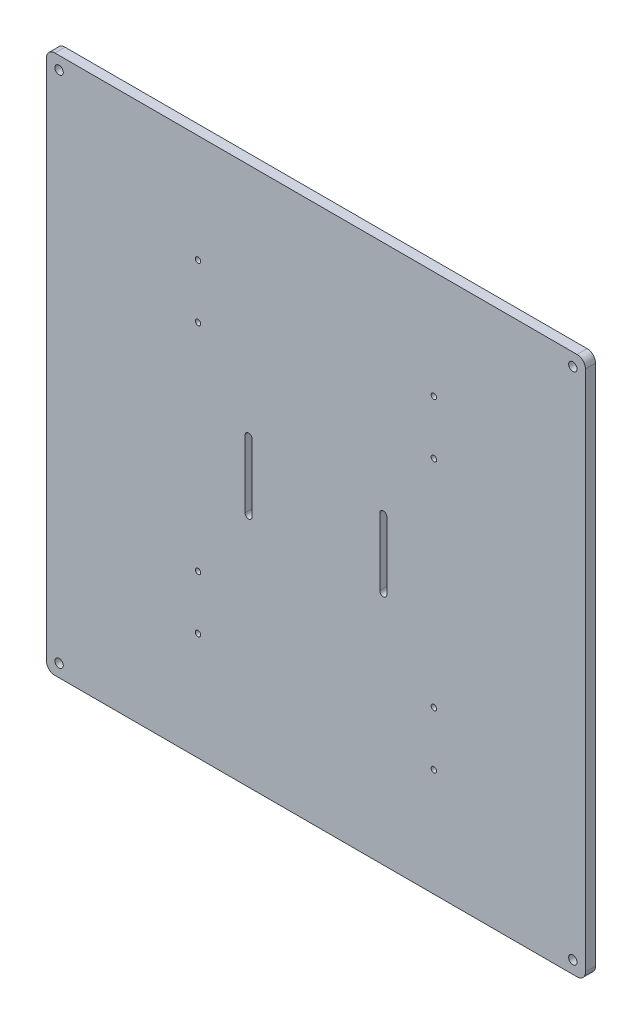
ISO-10303-21;
HEADER;
FILE_DESCRIPTION(('STEP AP214'),'2;1');
FILE_NAME('part.step','',(''),(''),'','','');
FILE_SCHEMA(('AUTOMOTIVE_DESIGN { 1 0 10303 214 1 1 1 1 }'));
ENDSEC;
DATA;
#1=APPLICATION_CONTEXT('core data for automotive mechanical design processes');
#2=APPLICATION_PROTOCOL_DEFINITION('international standard','automotive_design',2000,#1);
#3=PRODUCT_CONTEXT('',#1,'mechanical');
#4=PRODUCT('Part','Part','',(#3));
#5=PRODUCT_RELATED_PRODUCT_CATEGORY('part','',(#4));
#6=PRODUCT_DEFINITION_FORMATION('','',#4);
#7=PRODUCT_DEFINITION_CONTEXT('part definition',#1,'design');
#8=PRODUCT_DEFINITION('design','',#6,#7);
#9=PRODUCT_DEFINITION_SHAPE('','',#8);
#10=(LENGTH_UNIT() NAMED_UNIT(*) SI_UNIT(.MILLI.,.METRE.));
#11=(NAMED_UNIT(*) PLANE_ANGLE_UNIT() SI_UNIT($,.RADIAN.));
#12=(NAMED_UNIT(*) SI_UNIT($,.STERADIAN.) SOLID_ANGLE_UNIT());
#13=UNCERTAINTY_MEASURE_WITH_UNIT(LENGTH_MEASURE(1.E-05),#10,'distance_accuracy_value','');
#14=(GEOMETRIC_REPRESENTATION_CONTEXT(3) GLOBAL_UNCERTAINTY_ASSIGNED_CONTEXT((#13)) GLOBAL_UNIT_ASSIGNED_CONTEXT((#10,
#11,#12)) REPRESENTATION_CONTEXT('',''));
#15=CARTESIAN_POINT('',(0.,0.,0.));
#16=DIRECTION('',(0.,0.,1.));
#17=DIRECTION('',(1.,0.,0.));
#18=AXIS2_PLACEMENT_3D('',#15,#16,#17);
#19=CARTESIAN_POINT('',(0.,0.,6.));
#20=DIRECTION('',(0.,1.,0.));
#21=DIRECTION('',(0.,0.,1.));
#22=AXIS2_PLACEMENT_3D('',#19,#20,#21);
#23=PLANE('',#22);
#24=DIRECTION('',(1.,0.,0.));
#25=VECTOR('',#24,1.);
#26=CARTESIAN_POINT('',(0.,0.,0.));
#27=LINE('',#26,#25);
#28=CARTESIAN_POINT('',(5.,0.,0.));
#29=VERTEX_POINT('',#28);
#30=CARTESIAN_POINT('',(315.,0.,0.));
#31=VERTEX_POINT('',#30);
#32=EDGE_CURVE('E296',#29,#31,#27,.T.);
#33=ORIENTED_EDGE('',*,*,#32,.T.);
#34=DIRECTION('',(0.,0.,-1.));
#35=VECTOR('',#34,1.);
#36=CARTESIAN_POINT('',(315.,0.,6.));
#37=LINE('',#36,#35);
#38=CARTESIAN_POINT('',(315.,0.,6.));
#39=VERTEX_POINT('',#38);
#40=EDGE_CURVE('E43',#31,#39,#37,.F.);
#41=ORIENTED_EDGE('',*,*,#40,.T.);
#42=DIRECTION('',(1.,0.,0.));
#43=VECTOR('',#42,1.);
#44=CARTESIAN_POINT('',(0.,0.,6.));
#45=LINE('',#44,#43);
#46=CARTESIAN_POINT('',(5.,0.,6.));
#47=VERTEX_POINT('',#46);
#48=EDGE_CURVE('E274',#47,#39,#45,.T.);
#49=ORIENTED_EDGE('',*,*,#48,.F.);
#50=DIRECTION('',(0.,0.,-1.));
#51=VECTOR('',#50,1.);
#52=CARTESIAN_POINT('',(5.,0.,0.));
#53=LINE('',#52,#51);
#54=EDGE_CURVE('E317',#47,#29,#53,.T.);
#55=ORIENTED_EDGE('',*,*,#54,.T.);
#56=EDGE_LOOP('',(#33,#41,#49,#55));
#57=FACE_BOUND('',#56,.T.);
#58=ADVANCED_FACE('F35',(#57),#23,.F.);
#59=CARTESIAN_POINT('',(320.,0.,6.));
#60=DIRECTION('',(-1.,0.,0.));
#61=DIRECTION('',(0.,0.,1.));
#62=AXIS2_PLACEMENT_3D('',#59,#60,#61);
#63=PLANE('',#62);
#64=DIRECTION('',(0.,1.,0.));
#65=VECTOR('',#64,1.);
#66=CARTESIAN_POINT('',(320.,0.,6.));
#67=LINE('',#66,#65);
#68=CARTESIAN_POINT('',(320.,5.,6.));
#69=VERTEX_POINT('',#68);
#70=CARTESIAN_POINT('',(320.,315.,6.));
#71=VERTEX_POINT('',#70);
#72=EDGE_CURVE('E277',#69,#71,#67,.T.);
#73=ORIENTED_EDGE('',*,*,#72,.F.);
#74=DIRECTION('',(0.,0.,-1.));
#75=VECTOR('',#74,1.);
#76=CARTESIAN_POINT('',(320.,5.,6.));
#77=LINE('',#76,#75);
#78=CARTESIAN_POINT('',(320.,5.,0.));
#79=VERTEX_POINT('',#78);
#80=EDGE_CURVE('E337',#69,#79,#77,.T.);
#81=ORIENTED_EDGE('',*,*,#80,.T.);
#82=DIRECTION('',(0.,1.,0.));
#83=VECTOR('',#82,1.);
#84=CARTESIAN_POINT('',(320.,0.,0.));
#85=LINE('',#84,#83);
#86=CARTESIAN_POINT('',(320.,315.,0.));
#87=VERTEX_POINT('',#86);
#88=EDGE_CURVE('E299',#79,#87,#85,.T.);
#89=ORIENTED_EDGE('',*,*,#88,.T.);
#90=DIRECTION('',(0.,0.,-1.));
#91=VECTOR('',#90,1.);
#92=CARTESIAN_POINT('',(320.,315.,6.));
#93=LINE('',#92,#91);
#94=EDGE_CURVE('E332',#87,#71,#93,.F.);
#95=ORIENTED_EDGE('',*,*,#94,.T.);
#96=EDGE_LOOP('',(#73,#81,#89,#95));
#97=FACE_BOUND('',#96,.T.);
#98=ADVANCED_FACE('F356',(#97),#63,.F.);
#99=CARTESIAN_POINT('',(0.,320.,6.));
#100=DIRECTION('',(0.,1.,0.));
#101=DIRECTION('',(0.,0.,1.));
#102=AXIS2_PLACEMENT_3D('',#99,#100,#101);
#103=PLANE('',#102);
#104=DIRECTION('',(1.,0.,0.));
#105=VECTOR('',#104,1.);
#106=CARTESIAN_POINT('',(0.,320.,6.));
#107=LINE('',#106,#105);
#108=CARTESIAN_POINT('',(5.,320.,6.));
#109=VERTEX_POINT('',#108);
#110=CARTESIAN_POINT('',(315.,320.,6.));
#111=VERTEX_POINT('',#110);
#112=EDGE_CURVE('E279',#109,#111,#107,.T.);
#113=ORIENTED_EDGE('',*,*,#112,.T.);
#114=DIRECTION('',(0.,0.,-1.));
#115=VECTOR('',#114,1.);
#116=CARTESIAN_POINT('',(315.,320.,0.));
#117=LINE('',#116,#115);
#118=CARTESIAN_POINT('',(315.,320.,0.));
#119=VERTEX_POINT('',#118);
#120=EDGE_CURVE('E326',#111,#119,#117,.T.);
#121=ORIENTED_EDGE('',*,*,#120,.T.);
#122=DIRECTION('',(1.,0.,0.));
#123=VECTOR('',#122,1.);
#124=CARTESIAN_POINT('',(0.,320.,0.));
#125=LINE('',#124,#123);
#126=CARTESIAN_POINT('',(5.,320.,0.));
#127=VERTEX_POINT('',#126);
#128=EDGE_CURVE('E301',#127,#119,#125,.T.);
#129=ORIENTED_EDGE('',*,*,#128,.F.);
#130=DIRECTION('',(0.,0.,-1.));
#131=VECTOR('',#130,1.);
#132=CARTESIAN_POINT('',(5.,320.,6.));
#133=LINE('',#132,#131);
#134=EDGE_CURVE('E312',#127,#109,#133,.F.);
#135=ORIENTED_EDGE('',*,*,#134,.T.);
#136=EDGE_LOOP('',(#113,#121,#129,#135));
#137=FACE_BOUND('',#136,.T.);
#138=ADVANCED_FACE('F369',(#137),#103,.T.);
#139=CARTESIAN_POINT('',(0.,0.,6.));
#140=DIRECTION('',(-1.,0.,0.));
#141=DIRECTION('',(0.,0.,1.));
#142=AXIS2_PLACEMENT_3D('',#139,#140,#141);
#143=PLANE('',#142);
#144=DIRECTION('',(0.,1.,0.));
#145=VECTOR('',#144,1.);
#146=CARTESIAN_POINT('',(0.,0.,0.));
#147=LINE('',#146,#145);
#148=CARTESIAN_POINT('',(0.,5.,0.));
#149=VERTEX_POINT('',#148);
#150=CARTESIAN_POINT('',(0.,315.,0.));
#151=VERTEX_POINT('',#150);
#152=EDGE_CURVE('E304',#149,#151,#147,.T.);
#153=ORIENTED_EDGE('',*,*,#152,.F.);
#154=DIRECTION('',(0.,0.,-1.));
#155=VECTOR('',#154,1.);
#156=CARTESIAN_POINT('',(0.,5.,6.));
#157=LINE('',#156,#155);
#158=CARTESIAN_POINT('',(0.,5.,6.));
#159=VERTEX_POINT('',#158);
#160=EDGE_CURVE('E322',#149,#159,#157,.F.);
#161=ORIENTED_EDGE('',*,*,#160,.T.);
#162=DIRECTION('',(0.,1.,0.));
#163=VECTOR('',#162,1.);
#164=CARTESIAN_POINT('',(0.,0.,6.));
#165=LINE('',#164,#163);
#166=CARTESIAN_POINT('',(0.,315.,6.));
#167=VERTEX_POINT('',#166);
#168=EDGE_CURVE('E282',#159,#167,#165,.T.);
#169=ORIENTED_EDGE('',*,*,#168,.T.);
#170=DIRECTION('',(0.,0.,-1.));
#171=VECTOR('',#170,1.);
#172=CARTESIAN_POINT('',(0.,315.,6.));
#173=LINE('',#172,#171);
#174=EDGE_CURVE('E287',#167,#151,#173,.T.);
#175=ORIENTED_EDGE('',*,*,#174,.T.);
#176=EDGE_LOOP('',(#153,#161,#169,#175));
#177=FACE_BOUND('',#176,.T.);
#178=ADVANCED_FACE('F380',(#177),#143,.T.);
#179=CARTESIAN_POINT('',(7.5,312.5,6.));
#180=DIRECTION('',(0.,0.,-1.));
#181=DIRECTION('',(-1.,0.,0.));
#182=AXIS2_PLACEMENT_3D('',#179,#180,#181);
#183=CYLINDRICAL_SURFACE('',#182,2.5);
#184=CARTESIAN_POINT('',(7.5,312.5,6.));
#185=DIRECTION('',(0.,0.,1.));
#186=DIRECTION('',(1.,0.,0.));
#187=AXIS2_PLACEMENT_3D('',#184,#185,#186);
#188=CIRCLE('',#187,2.5);
#189=CARTESIAN_POINT('',(10.,312.5,6.));
#190=VERTEX_POINT('',#189);
#191=EDGE_CURVE('E271',#190,#190,#188,.T.);
#192=ORIENTED_EDGE('',*,*,#191,.T.);
#193=EDGE_LOOP('',(#192));
#194=FACE_BOUND('',#193,.T.);
#195=CARTESIAN_POINT('',(7.5,312.5,0.));
#196=DIRECTION('',(0.,0.,1.));
#197=DIRECTION('',(1.,0.,0.));
#198=AXIS2_PLACEMENT_3D('',#195,#196,#197);
#199=CIRCLE('',#198,2.5);
#200=CARTESIAN_POINT('',(10.,312.5,0.));
#201=VERTEX_POINT('',#200);
#202=EDGE_CURVE('E293',#201,#201,#199,.T.);
#203=ORIENTED_EDGE('',*,*,#202,.F.);
#204=EDGE_LOOP('',(#203));
#205=FACE_BOUND('',#204,.T.);
#206=ADVANCED_FACE('F382',(#194,#205),#183,.F.);
#207=CARTESIAN_POINT('',(312.5,312.5,6.));
#208=DIRECTION('',(0.,0.,-1.));
#209=DIRECTION('',(-1.,0.,0.));
#210=AXIS2_PLACEMENT_3D('',#207,#208,#209);
#211=CYLINDRICAL_SURFACE('',#210,2.50000000000002);
#212=CARTESIAN_POINT('',(312.5,312.5,6.));
#213=DIRECTION('',(0.,0.,1.));
#214=DIRECTION('',(1.,0.,0.));
#215=AXIS2_PLACEMENT_3D('',#212,#213,#214);
#216=CIRCLE('',#215,2.50000000000002);
#217=CARTESIAN_POINT('',(315.,312.5,6.));
#218=VERTEX_POINT('',#217);
#219=EDGE_CURVE('E267',#218,#218,#216,.F.);
#220=ORIENTED_EDGE('',*,*,#219,.F.);
#221=EDGE_LOOP('',(#220));
#222=FACE_BOUND('',#221,.T.);
#223=CARTESIAN_POINT('',(312.5,312.5,0.));
#224=DIRECTION('',(0.,0.,1.));
#225=DIRECTION('',(1.,0.,0.));
#226=AXIS2_PLACEMENT_3D('',#223,#224,#225);
#227=CIRCLE('',#226,2.50000000000002);
#228=CARTESIAN_POINT('',(315.,312.5,0.));
#229=VERTEX_POINT('',#228);
#230=EDGE_CURVE('E290',#229,#229,#227,.F.);
#231=ORIENTED_EDGE('',*,*,#230,.T.);
#232=EDGE_LOOP('',(#231));
#233=FACE_BOUND('',#232,.T.);
#234=ADVANCED_FACE('F388',(#222,#233),#211,.F.);
#235=CARTESIAN_POINT('',(312.5,7.50000000000001,6.));
#236=DIRECTION('',(0.,0.,-1.));
#237=DIRECTION('',(-1.,0.,0.));
#238=AXIS2_PLACEMENT_3D('',#235,#236,#237);
#239=CYLINDRICAL_SURFACE('',#238,2.50000000000002);
#240=CARTESIAN_POINT('',(312.5,7.50000000000001,6.));
#241=DIRECTION('',(0.,0.,1.));
#242=DIRECTION('',(1.,0.,0.));
#243=AXIS2_PLACEMENT_3D('',#240,#241,#242);
#244=CIRCLE('',#243,2.50000000000002);
#245=CARTESIAN_POINT('',(315.,7.50000000000001,6.));
#246=VERTEX_POINT('',#245);
#247=EDGE_CURVE('E264',#246,#246,#244,.T.);
#248=ORIENTED_EDGE('',*,*,#247,.T.);
#249=EDGE_LOOP('',(#248));
#250=FACE_BOUND('',#249,.T.);
#251=CARTESIAN_POINT('',(312.5,7.50000000000001,0.));
#252=DIRECTION('',(0.,0.,1.));
#253=DIRECTION('',(1.,0.,0.));
#254=AXIS2_PLACEMENT_3D('',#251,#252,#253);
#255=CIRCLE('',#254,2.50000000000002);
#256=CARTESIAN_POINT('',(315.,7.50000000000001,0.));
#257=VERTEX_POINT('',#256);
#258=EDGE_CURVE('E261',#257,#257,#255,.T.);
#259=ORIENTED_EDGE('',*,*,#258,.F.);
#260=EDGE_LOOP('',(#259));
#261=FACE_BOUND('',#260,.T.);
#262=ADVANCED_FACE('F402',(#250,#261),#239,.F.);
#263=CARTESIAN_POINT('',(7.5,7.50000000000001,6.));
#264=DIRECTION('',(0.,0.,-1.));
#265=DIRECTION('',(-1.,0.,0.));
#266=AXIS2_PLACEMENT_3D('',#263,#264,#265);
#267=CYLINDRICAL_SURFACE('',#266,2.5);
#268=CARTESIAN_POINT('',(7.5,7.50000000000001,6.));
#269=DIRECTION('',(0.,0.,1.));
#270=DIRECTION('',(1.,0.,0.));
#271=AXIS2_PLACEMENT_3D('',#268,#269,#270);
#272=CIRCLE('',#271,2.5);
#273=CARTESIAN_POINT('',(10.,7.50000000000001,6.));
#274=VERTEX_POINT('',#273);
#275=EDGE_CURVE('E284',#274,#274,#272,.F.);
#276=ORIENTED_EDGE('',*,*,#275,.F.);
#277=EDGE_LOOP('',(#276));
#278=FACE_BOUND('',#277,.T.);
#279=CARTESIAN_POINT('',(7.5,7.50000000000001,0.));
#280=DIRECTION('',(0.,0.,1.));
#281=DIRECTION('',(1.,0.,0.));
#282=AXIS2_PLACEMENT_3D('',#279,#280,#281);
#283=CIRCLE('',#282,2.5);
#284=CARTESIAN_POINT('',(10.,7.50000000000001,0.));
#285=VERTEX_POINT('',#284);
#286=EDGE_CURVE('E268',#285,#285,#283,.F.);
#287=ORIENTED_EDGE('',*,*,#286,.T.);
#288=EDGE_LOOP('',(#287));
#289=FACE_BOUND('',#288,.T.);
#290=ADVANCED_FACE('F406',(#278,#289),#267,.F.);
#291=CARTESIAN_POINT('',(0.,0.,6.));
#292=DIRECTION('',(0.,0.,1.));
#293=DIRECTION('',(1.,0.,0.));
#294=AXIS2_PLACEMENT_3D('',#291,#292,#293);
#295=PLANE('',#294);
#296=CARTESIAN_POINT('',(120.,180.,6.));
#297=DIRECTION('',(0.,0.,-1.));
#298=DIRECTION('',(-1.,0.,0.));
#299=AXIS2_PLACEMENT_3D('',#296,#297,#298);
#300=CIRCLE('',#299,2.09999999999999);
#301=CARTESIAN_POINT('',(117.9,180.,6.));
#302=VERTEX_POINT('',#301);
#303=CARTESIAN_POINT('',(122.1,180.,6.));
#304=VERTEX_POINT('',#303);
#305=EDGE_CURVE('E149',#302,#304,#300,.T.);
#306=ORIENTED_EDGE('',*,*,#305,.T.);
#307=DIRECTION('',(0.,-1.,0.));
#308=VECTOR('',#307,1.);
#309=CARTESIAN_POINT('',(122.1,180.,6.));
#310=LINE('',#309,#308);
#311=CARTESIAN_POINT('',(122.1,140.,6.));
#312=VERTEX_POINT('',#311);
#313=EDGE_CURVE('E158',#304,#312,#310,.T.);
#314=ORIENTED_EDGE('',*,*,#313,.T.);
#315=CARTESIAN_POINT('',(120.,140.,6.));
#316=DIRECTION('',(0.,0.,-1.));
#317=DIRECTION('',(-1.,0.,0.));
#318=AXIS2_PLACEMENT_3D('',#315,#316,#317);
#319=CIRCLE('',#318,2.09999999999998);
#320=CARTESIAN_POINT('',(117.9,140.,6.));
#321=VERTEX_POINT('',#320);
#322=EDGE_CURVE('E50',#312,#321,#319,.T.);
#323=ORIENTED_EDGE('',*,*,#322,.T.);
#324=DIRECTION('',(0.,1.,0.));
#325=VECTOR('',#324,1.);
#326=CARTESIAN_POINT('',(117.9,180.,6.));
#327=LINE('',#326,#325);
#328=EDGE_CURVE('E155',#321,#302,#327,.T.);
#329=ORIENTED_EDGE('',*,*,#328,.T.);
#330=EDGE_LOOP('',(#306,#314,#323,#329));
#331=FACE_BOUND('',#330,.T.);
#332=CARTESIAN_POINT('',(200.,180.,6.));
#333=DIRECTION('',(0.,0.,-1.));
#334=DIRECTION('',(-1.,0.,0.));
#335=AXIS2_PLACEMENT_3D('',#332,#333,#334);
#336=CIRCLE('',#335,2.10000000000002);
#337=CARTESIAN_POINT('',(197.9,180.,6.));
#338=VERTEX_POINT('',#337);
#339=CARTESIAN_POINT('',(202.1,180.,6.));
#340=VERTEX_POINT('',#339);
#341=EDGE_CURVE('E184',#338,#340,#336,.T.);
#342=ORIENTED_EDGE('',*,*,#341,.T.);
#343=DIRECTION('',(0.,-1.,0.));
#344=VECTOR('',#343,1.);
#345=CARTESIAN_POINT('',(202.1,180.,6.));
#346=LINE('',#345,#344);
#347=CARTESIAN_POINT('',(202.1,140.,6.));
#348=VERTEX_POINT('',#347);
#349=EDGE_CURVE('E187',#340,#348,#346,.T.);
#350=ORIENTED_EDGE('',*,*,#349,.T.);
#351=CARTESIAN_POINT('',(200.,140.,6.));
#352=DIRECTION('',(0.,0.,-1.));
#353=DIRECTION('',(-1.,0.,0.));
#354=AXIS2_PLACEMENT_3D('',#351,#352,#353);
#355=CIRCLE('',#354,2.09999999999999);
#356=CARTESIAN_POINT('',(197.9,140.,6.));
#357=VERTEX_POINT('',#356);
#358=EDGE_CURVE('E191',#348,#357,#355,.T.);
#359=ORIENTED_EDGE('',*,*,#358,.T.);
#360=DIRECTION('',(0.,1.,0.));
#361=VECTOR('',#360,1.);
#362=CARTESIAN_POINT('',(197.9,180.,6.));
#363=LINE('',#362,#361);
#364=EDGE_CURVE('E194',#357,#338,#363,.T.);
#365=ORIENTED_EDGE('',*,*,#364,.T.);
#366=EDGE_LOOP('',(#342,#350,#359,#365));
#367=FACE_BOUND('',#366,.T.);
#368=CARTESIAN_POINT('',(230.,256.,6.));
#369=DIRECTION('',(0.,0.,1.));
#370=DIRECTION('',(1.,0.,0.));
#371=AXIS2_PLACEMENT_3D('',#368,#369,#370);
#372=CIRCLE('',#371,1.59999999999999);
#373=CARTESIAN_POINT('',(231.6,256.,6.));
#374=VERTEX_POINT('',#373);
#375=EDGE_CURVE('E209',#374,#374,#372,.T.);
#376=ORIENTED_EDGE('',*,*,#375,.F.);
#377=EDGE_LOOP('',(#376));
#378=FACE_BOUND('',#377,.T.);
#379=CARTESIAN_POINT('',(230.,64.,6.));
#380=DIRECTION('',(0.,0.,1.));
#381=DIRECTION('',(1.,0.,0.));
#382=AXIS2_PLACEMENT_3D('',#379,#380,#381);
#383=CIRCLE('',#382,1.59999999999999);
#384=CARTESIAN_POINT('',(231.6,64.,6.));
#385=VERTEX_POINT('',#384);
#386=EDGE_CURVE('E219',#385,#385,#383,.T.);
#387=ORIENTED_EDGE('',*,*,#386,.F.);
#388=EDGE_LOOP('',(#387));
#389=FACE_BOUND('',#388,.T.);
#390=CARTESIAN_POINT('',(90.,64.,6.));
#391=DIRECTION('',(0.,0.,1.));
#392=DIRECTION('',(1.,0.,0.));
#393=AXIS2_PLACEMENT_3D('',#390,#391,#392);
#394=CIRCLE('',#393,1.60000000000001);
#395=CARTESIAN_POINT('',(91.6,64.,6.));
#396=VERTEX_POINT('',#395);
#397=EDGE_CURVE('E225',#396,#396,#394,.T.);
#398=ORIENTED_EDGE('',*,*,#397,.F.);
#399=EDGE_LOOP('',(#398));
#400=FACE_BOUND('',#399,.T.);
#401=CARTESIAN_POINT('',(90.,256.,6.));
#402=DIRECTION('',(0.,0.,1.));
#403=DIRECTION('',(1.,0.,0.));
#404=AXIS2_PLACEMENT_3D('',#401,#402,#403);
#405=CIRCLE('',#404,1.6);
#406=CARTESIAN_POINT('',(91.6,256.,6.));
#407=VERTEX_POINT('',#406);
#408=EDGE_CURVE('E231',#407,#407,#405,.T.);
#409=ORIENTED_EDGE('',*,*,#408,.F.);
#410=EDGE_LOOP('',(#409));
#411=FACE_BOUND('',#410,.T.);
#412=CARTESIAN_POINT('',(230.,96.,6.));
#413=DIRECTION('',(0.,0.,1.));
#414=DIRECTION('',(1.,0.,0.));
#415=AXIS2_PLACEMENT_3D('',#412,#413,#414);
#416=CIRCLE('',#415,1.59999999999996);
#417=CARTESIAN_POINT('',(231.6,96.,6.));
#418=VERTEX_POINT('',#417);
#419=EDGE_CURVE('E237',#418,#418,#416,.T.);
#420=ORIENTED_EDGE('',*,*,#419,.F.);
#421=EDGE_LOOP('',(#420));
#422=FACE_BOUND('',#421,.T.);
#423=CARTESIAN_POINT('',(90.,96.,6.));
#424=DIRECTION('',(0.,0.,1.));
#425=DIRECTION('',(1.,0.,0.));
#426=AXIS2_PLACEMENT_3D('',#423,#424,#425);
#427=CIRCLE('',#426,1.60000000000001);
#428=CARTESIAN_POINT('',(91.6,96.,6.));
#429=VERTEX_POINT('',#428);
#430=EDGE_CURVE('E243',#429,#429,#427,.T.);
#431=ORIENTED_EDGE('',*,*,#430,.F.);
#432=EDGE_LOOP('',(#431));
#433=FACE_BOUND('',#432,.T.);
#434=CARTESIAN_POINT('',(230.,224.,6.));
#435=DIRECTION('',(0.,0.,1.));
#436=DIRECTION('',(1.,0.,0.));
#437=AXIS2_PLACEMENT_3D('',#434,#435,#436);
#438=CIRCLE('',#437,1.59999999999996);
#439=CARTESIAN_POINT('',(231.6,224.,6.));
#440=VERTEX_POINT('',#439);
#441=EDGE_CURVE('E249',#440,#440,#438,.T.);
#442=ORIENTED_EDGE('',*,*,#441,.F.);
#443=EDGE_LOOP('',(#442));
#444=FACE_BOUND('',#443,.T.);
#445=CARTESIAN_POINT('',(90.,224.,6.));
#446=DIRECTION('',(0.,0.,1.));
#447=DIRECTION('',(1.,0.,0.));
#448=AXIS2_PLACEMENT_3D('',#445,#446,#447);
#449=CIRCLE('',#448,1.6);
#450=CARTESIAN_POINT('',(91.6,224.,6.));
#451=VERTEX_POINT('',#450);
#452=EDGE_CURVE('E255',#451,#451,#449,.T.);
#453=ORIENTED_EDGE('',*,*,#452,.F.);
#454=EDGE_LOOP('',(#453));
#455=FACE_BOUND('',#454,.T.);
#456=ORIENTED_EDGE('',*,*,#247,.F.);
#457=EDGE_LOOP('',(#456));
#458=FACE_BOUND('',#457,.T.);
#459=ORIENTED_EDGE('',*,*,#219,.T.);
#460=EDGE_LOOP('',(#459));
#461=FACE_BOUND('',#460,.T.);
#462=ORIENTED_EDGE('',*,*,#191,.F.);
#463=EDGE_LOOP('',(#462));
#464=FACE_BOUND('',#463,.T.);
#465=ORIENTED_EDGE('',*,*,#48,.T.);
#466=CARTESIAN_POINT('',(315.,5.,6.));
#467=DIRECTION('',(0.,0.,1.));
#468=DIRECTION('',(1.,0.,0.));
#469=AXIS2_PLACEMENT_3D('',#466,#467,#468);
#470=CIRCLE('',#469,5.);
#471=EDGE_CURVE('E11',#39,#69,#470,.T.);
#472=ORIENTED_EDGE('',*,*,#471,.T.);
#473=ORIENTED_EDGE('',*,*,#72,.T.);
#474=CARTESIAN_POINT('',(315.,315.,6.));
#475=DIRECTION('',(0.,0.,1.));
#476=DIRECTION('',(1.,0.,0.));
#477=AXIS2_PLACEMENT_3D('',#474,#475,#476);
#478=CIRCLE('',#477,5.);
#479=EDGE_CURVE('E335',#71,#111,#478,.T.);
#480=ORIENTED_EDGE('',*,*,#479,.T.);
#481=ORIENTED_EDGE('',*,*,#112,.F.);
#482=CARTESIAN_POINT('',(5.,315.,6.));
#483=DIRECTION('',(0.,0.,1.));
#484=DIRECTION('',(1.,0.,0.));
#485=AXIS2_PLACEMENT_3D('',#482,#483,#484);
#486=CIRCLE('',#485,5.);
#487=EDGE_CURVE('E314',#109,#167,#486,.T.);
#488=ORIENTED_EDGE('',*,*,#487,.T.);
#489=ORIENTED_EDGE('',*,*,#168,.F.);
#490=CARTESIAN_POINT('',(5.,5.,6.));
#491=DIRECTION('',(0.,0.,1.));
#492=DIRECTION('',(1.,0.,0.));
#493=AXIS2_PLACEMENT_3D('',#490,#491,#492);
#494=CIRCLE('',#493,5.);
#495=EDGE_CURVE('E324',#159,#47,#494,.T.);
#496=ORIENTED_EDGE('',*,*,#495,.T.);
#497=EDGE_LOOP('',(#465,#472,#473,#480,#481,#488,#489,#496));
#498=FACE_BOUND('',#497,.T.);
#499=ORIENTED_EDGE('',*,*,#275,.T.);
#500=EDGE_LOOP('',(#499));
#501=FACE_BOUND('',#500,.T.);
#502=ADVANCED_FACE('F162',(#331,#367,#378,#389,#400,#411,#422,#433,#444,#455,#458,#461,#464,
#498,#501),#295,.T.);
#503=CARTESIAN_POINT('',(0.,0.,0.));
#504=DIRECTION('',(0.,0.,1.));
#505=DIRECTION('',(1.,0.,0.));
#506=AXIS2_PLACEMENT_3D('',#503,#504,#505);
#507=PLANE('',#506);
#508=DIRECTION('',(0.,-1.,0.));
#509=VECTOR('',#508,1.);
#510=CARTESIAN_POINT('',(122.1,180.,0.));
#511=LINE('',#510,#509);
#512=CARTESIAN_POINT('',(122.1,180.,0.));
#513=VERTEX_POINT('',#512);
#514=CARTESIAN_POINT('',(122.1,140.,0.));
#515=VERTEX_POINT('',#514);
#516=EDGE_CURVE('E174',#513,#515,#511,.T.);
#517=ORIENTED_EDGE('',*,*,#516,.F.);
#518=CARTESIAN_POINT('',(120.,180.,0.));
#519=DIRECTION('',(0.,0.,-1.));
#520=DIRECTION('',(-1.,0.,0.));
#521=AXIS2_PLACEMENT_3D('',#518,#519,#520);
#522=CIRCLE('',#521,2.09999999999999);
#523=CARTESIAN_POINT('',(117.9,180.,0.));
#524=VERTEX_POINT('',#523);
#525=EDGE_CURVE('E58',#524,#513,#522,.T.);
#526=ORIENTED_EDGE('',*,*,#525,.F.);
#527=DIRECTION('',(0.,1.,0.));
#528=VECTOR('',#527,1.);
#529=CARTESIAN_POINT('',(117.9,180.,0.));
#530=LINE('',#529,#528);
#531=CARTESIAN_POINT('',(117.9,140.,0.));
#532=VERTEX_POINT('',#531);
#533=EDGE_CURVE('E165',#532,#524,#530,.T.);
#534=ORIENTED_EDGE('',*,*,#533,.F.);
#535=CARTESIAN_POINT('',(120.,140.,0.));
#536=DIRECTION('',(0.,0.,-1.));
#537=DIRECTION('',(-1.,0.,0.));
#538=AXIS2_PLACEMENT_3D('',#535,#536,#537);
#539=CIRCLE('',#538,2.09999999999998);
#540=EDGE_CURVE('E168',#515,#532,#539,.T.);
#541=ORIENTED_EDGE('',*,*,#540,.F.);
#542=EDGE_LOOP('',(#517,#526,#534,#541));
#543=FACE_BOUND('',#542,.T.);
#544=DIRECTION('',(0.,-1.,0.));
#545=VECTOR('',#544,1.);
#546=CARTESIAN_POINT('',(202.1,180.,0.));
#547=LINE('',#546,#545);
#548=CARTESIAN_POINT('',(202.1,180.,0.));
#549=VERTEX_POINT('',#548);
#550=CARTESIAN_POINT('',(202.1,140.,0.));
#551=VERTEX_POINT('',#550);
#552=EDGE_CURVE('E199',#549,#551,#547,.T.);
#553=ORIENTED_EDGE('',*,*,#552,.F.);
#554=CARTESIAN_POINT('',(200.,180.,0.));
#555=DIRECTION('',(0.,0.,-1.));
#556=DIRECTION('',(-1.,0.,0.));
#557=AXIS2_PLACEMENT_3D('',#554,#555,#556);
#558=CIRCLE('',#557,2.10000000000002);
#559=CARTESIAN_POINT('',(197.9,180.,0.));
#560=VERTEX_POINT('',#559);
#561=EDGE_CURVE('E180',#560,#549,#558,.T.);
#562=ORIENTED_EDGE('',*,*,#561,.F.);
#563=DIRECTION('',(0.,1.,0.));
#564=VECTOR('',#563,1.);
#565=CARTESIAN_POINT('',(197.9,180.,0.));
#566=LINE('',#565,#564);
#567=CARTESIAN_POINT('',(197.9,140.,0.));
#568=VERTEX_POINT('',#567);
#569=EDGE_CURVE('E188',#568,#560,#566,.T.);
#570=ORIENTED_EDGE('',*,*,#569,.F.);
#571=CARTESIAN_POINT('',(200.,140.,0.));
#572=DIRECTION('',(0.,0.,-1.));
#573=DIRECTION('',(-1.,0.,0.));
#574=AXIS2_PLACEMENT_3D('',#571,#572,#573);
#575=CIRCLE('',#574,2.09999999999999);
#576=EDGE_CURVE('E202',#551,#568,#575,.T.);
#577=ORIENTED_EDGE('',*,*,#576,.F.);
#578=EDGE_LOOP('',(#553,#562,#570,#577));
#579=FACE_BOUND('',#578,.T.);
#580=CARTESIAN_POINT('',(230.,256.,0.));
#581=DIRECTION('',(0.,0.,1.));
#582=DIRECTION('',(1.,0.,0.));
#583=AXIS2_PLACEMENT_3D('',#580,#581,#582);
#584=CIRCLE('',#583,1.59999999999999);
#585=CARTESIAN_POINT('',(231.6,256.,0.));
#586=VERTEX_POINT('',#585);
#587=EDGE_CURVE('E216',#586,#586,#584,.T.);
#588=ORIENTED_EDGE('',*,*,#587,.T.);
#589=EDGE_LOOP('',(#588));
#590=FACE_BOUND('',#589,.T.);
#591=CARTESIAN_POINT('',(230.,64.,0.));
#592=DIRECTION('',(0.,0.,1.));
#593=DIRECTION('',(1.,0.,0.));
#594=AXIS2_PLACEMENT_3D('',#591,#592,#593);
#595=CIRCLE('',#594,1.59999999999999);
#596=CARTESIAN_POINT('',(231.6,64.,0.));
#597=VERTEX_POINT('',#596);
#598=EDGE_CURVE('E222',#597,#597,#595,.T.);
#599=ORIENTED_EDGE('',*,*,#598,.T.);
#600=EDGE_LOOP('',(#599));
#601=FACE_BOUND('',#600,.T.);
#602=CARTESIAN_POINT('',(90.,64.,0.));
#603=DIRECTION('',(0.,0.,1.));
#604=DIRECTION('',(1.,0.,0.));
#605=AXIS2_PLACEMENT_3D('',#602,#603,#604);
#606=CIRCLE('',#605,1.60000000000001);
#607=CARTESIAN_POINT('',(91.6,64.,0.));
#608=VERTEX_POINT('',#607);
#609=EDGE_CURVE('E228',#608,#608,#606,.T.);
#610=ORIENTED_EDGE('',*,*,#609,.T.);
#611=EDGE_LOOP('',(#610));
#612=FACE_BOUND('',#611,.T.);
#613=CARTESIAN_POINT('',(90.,256.,0.));
#614=DIRECTION('',(0.,0.,1.));
#615=DIRECTION('',(1.,0.,0.));
#616=AXIS2_PLACEMENT_3D('',#613,#614,#615);
#617=CIRCLE('',#616,1.6);
#618=CARTESIAN_POINT('',(91.6,256.,0.));
#619=VERTEX_POINT('',#618);
#620=EDGE_CURVE('E234',#619,#619,#617,.T.);
#621=ORIENTED_EDGE('',*,*,#620,.T.);
#622=EDGE_LOOP('',(#621));
#623=FACE_BOUND('',#622,.T.);
#624=CARTESIAN_POINT('',(230.,96.,0.));
#625=DIRECTION('',(0.,0.,1.));
#626=DIRECTION('',(1.,0.,0.));
#627=AXIS2_PLACEMENT_3D('',#624,#625,#626);
#628=CIRCLE('',#627,1.59999999999996);
#629=CARTESIAN_POINT('',(231.6,96.,0.));
#630=VERTEX_POINT('',#629);
#631=EDGE_CURVE('E240',#630,#630,#628,.T.);
#632=ORIENTED_EDGE('',*,*,#631,.T.);
#633=EDGE_LOOP('',(#632));
#634=FACE_BOUND('',#633,.T.);
#635=CARTESIAN_POINT('',(90.,96.,0.));
#636=DIRECTION('',(0.,0.,1.));
#637=DIRECTION('',(1.,0.,0.));
#638=AXIS2_PLACEMENT_3D('',#635,#636,#637);
#639=CIRCLE('',#638,1.60000000000001);
#640=CARTESIAN_POINT('',(91.6,96.,0.));
#641=VERTEX_POINT('',#640);
#642=EDGE_CURVE('E246',#641,#641,#639,.T.);
#643=ORIENTED_EDGE('',*,*,#642,.T.);
#644=EDGE_LOOP('',(#643));
#645=FACE_BOUND('',#644,.T.);
#646=CARTESIAN_POINT('',(230.,224.,0.));
#647=DIRECTION('',(0.,0.,1.));
#648=DIRECTION('',(1.,0.,0.));
#649=AXIS2_PLACEMENT_3D('',#646,#647,#648);
#650=CIRCLE('',#649,1.59999999999996);
#651=CARTESIAN_POINT('',(231.6,224.,0.));
#652=VERTEX_POINT('',#651);
#653=EDGE_CURVE('E252',#652,#652,#650,.T.);
#654=ORIENTED_EDGE('',*,*,#653,.T.);
#655=EDGE_LOOP('',(#654));
#656=FACE_BOUND('',#655,.T.);
#657=CARTESIAN_POINT('',(90.,224.,0.));
#658=DIRECTION('',(0.,0.,1.));
#659=DIRECTION('',(1.,0.,0.));
#660=AXIS2_PLACEMENT_3D('',#657,#658,#659);
#661=CIRCLE('',#660,1.6);
#662=CARTESIAN_POINT('',(91.6,224.,0.));
#663=VERTEX_POINT('',#662);
#664=EDGE_CURVE('E258',#663,#663,#661,.T.);
#665=ORIENTED_EDGE('',*,*,#664,.T.);
#666=EDGE_LOOP('',(#665));
#667=FACE_BOUND('',#666,.T.);
#668=ORIENTED_EDGE('',*,*,#258,.T.);
#669=EDGE_LOOP('',(#668));
#670=FACE_BOUND('',#669,.T.);
#671=ORIENTED_EDGE('',*,*,#230,.F.);
#672=EDGE_LOOP('',(#671));
#673=FACE_BOUND('',#672,.T.);
#674=ORIENTED_EDGE('',*,*,#202,.T.);
#675=EDGE_LOOP('',(#674));
#676=FACE_BOUND('',#675,.T.);
#677=ORIENTED_EDGE('',*,*,#88,.F.);
#678=CARTESIAN_POINT('',(315.,5.,0.));
#679=DIRECTION('',(0.,0.,1.));
#680=DIRECTION('',(1.,0.,0.));
#681=AXIS2_PLACEMENT_3D('',#678,#679,#680);
#682=CIRCLE('',#681,5.);
#683=EDGE_CURVE('E340',#79,#31,#682,.F.);
#684=ORIENTED_EDGE('',*,*,#683,.T.);
#685=ORIENTED_EDGE('',*,*,#32,.F.);
#686=CARTESIAN_POINT('',(5.,5.,0.));
#687=DIRECTION('',(0.,0.,1.));
#688=DIRECTION('',(1.,0.,0.));
#689=AXIS2_PLACEMENT_3D('',#686,#687,#688);
#690=CIRCLE('',#689,5.);
#691=EDGE_CURVE('E320',#29,#149,#690,.F.);
#692=ORIENTED_EDGE('',*,*,#691,.T.);
#693=ORIENTED_EDGE('',*,*,#152,.T.);
#694=CARTESIAN_POINT('',(5.,315.,0.));
#695=DIRECTION('',(0.,0.,1.));
#696=DIRECTION('',(1.,0.,0.));
#697=AXIS2_PLACEMENT_3D('',#694,#695,#696);
#698=CIRCLE('',#697,5.);
#699=EDGE_CURVE('E310',#151,#127,#698,.F.);
#700=ORIENTED_EDGE('',*,*,#699,.T.);
#701=ORIENTED_EDGE('',*,*,#128,.T.);
#702=CARTESIAN_POINT('',(315.,315.,0.));
#703=DIRECTION('',(0.,0.,1.));
#704=DIRECTION('',(1.,0.,0.));
#705=AXIS2_PLACEMENT_3D('',#702,#703,#704);
#706=CIRCLE('',#705,5.);
#707=EDGE_CURVE('E329',#119,#87,#706,.F.);
#708=ORIENTED_EDGE('',*,*,#707,.T.);
#709=EDGE_LOOP('',(#677,#684,#685,#692,#693,#700,#701,#708));
#710=FACE_BOUND('',#709,.T.);
#711=ORIENTED_EDGE('',*,*,#286,.F.);
#712=EDGE_LOOP('',(#711));
#713=FACE_BOUND('',#712,.T.);
#714=ADVANCED_FACE('F358',(#543,#579,#590,#601,#612,#623,#634,#645,#656,#667,#670,#673,#676,
#710,#713),#507,.F.);
#715=CARTESIAN_POINT('',(5.,315.,6.));
#716=DIRECTION('',(0.,0.,-1.));
#717=DIRECTION('',(-1.,0.,0.));
#718=AXIS2_PLACEMENT_3D('',#715,#716,#717);
#719=CYLINDRICAL_SURFACE('',#718,5.);
#720=ORIENTED_EDGE('',*,*,#487,.F.);
#721=ORIENTED_EDGE('',*,*,#134,.F.);
#722=ORIENTED_EDGE('',*,*,#699,.F.);
#723=ORIENTED_EDGE('',*,*,#174,.F.);
#724=EDGE_LOOP('',(#720,#721,#722,#723));
#725=FACE_BOUND('',#724,.T.);
#726=ADVANCED_FACE('F373',(#725),#719,.T.);
#727=CARTESIAN_POINT('',(5.,5.,6.));
#728=DIRECTION('',(0.,0.,1.));
#729=DIRECTION('',(1.,0.,0.));
#730=AXIS2_PLACEMENT_3D('',#727,#728,#729);
#731=CYLINDRICAL_SURFACE('',#730,5.);
#732=ORIENTED_EDGE('',*,*,#495,.F.);
#733=ORIENTED_EDGE('',*,*,#160,.F.);
#734=ORIENTED_EDGE('',*,*,#691,.F.);
#735=ORIENTED_EDGE('',*,*,#54,.F.);
#736=EDGE_LOOP('',(#732,#733,#734,#735));
#737=FACE_BOUND('',#736,.T.);
#738=ADVANCED_FACE('F378',(#737),#731,.T.);
#739=CARTESIAN_POINT('',(315.,315.,6.));
#740=DIRECTION('',(0.,0.,1.));
#741=DIRECTION('',(1.,0.,0.));
#742=AXIS2_PLACEMENT_3D('',#739,#740,#741);
#743=CYLINDRICAL_SURFACE('',#742,5.);
#744=ORIENTED_EDGE('',*,*,#479,.F.);
#745=ORIENTED_EDGE('',*,*,#94,.F.);
#746=ORIENTED_EDGE('',*,*,#707,.F.);
#747=ORIENTED_EDGE('',*,*,#120,.F.);
#748=EDGE_LOOP('',(#744,#745,#746,#747));
#749=FACE_BOUND('',#748,.T.);
#750=ADVANCED_FACE('F365',(#749),#743,.T.);
#751=CARTESIAN_POINT('',(315.,5.,6.));
#752=DIRECTION('',(0.,0.,-1.));
#753=DIRECTION('',(-1.,0.,0.));
#754=AXIS2_PLACEMENT_3D('',#751,#752,#753);
#755=CYLINDRICAL_SURFACE('',#754,5.);
#756=ORIENTED_EDGE('',*,*,#471,.F.);
#757=ORIENTED_EDGE('',*,*,#40,.F.);
#758=ORIENTED_EDGE('',*,*,#683,.F.);
#759=ORIENTED_EDGE('',*,*,#80,.F.);
#760=EDGE_LOOP('',(#756,#757,#758,#759));
#761=FACE_BOUND('',#760,.T.);
#762=ADVANCED_FACE('F37',(#761),#755,.T.);
#763=CARTESIAN_POINT('',(90.,224.,0.));
#764=DIRECTION('',(0.,0.,1.));
#765=DIRECTION('',(1.,0.,0.));
#766=AXIS2_PLACEMENT_3D('',#763,#764,#765);
#767=CYLINDRICAL_SURFACE('',#766,1.6);
#768=ORIENTED_EDGE('',*,*,#664,.F.);
#769=EDGE_LOOP('',(#768));
#770=FACE_BOUND('',#769,.T.);
#771=ORIENTED_EDGE('',*,*,#452,.T.);
#772=EDGE_LOOP('',(#771));
#773=FACE_BOUND('',#772,.T.);
#774=ADVANCED_FACE('F415',(#770,#773),#767,.F.);
#775=CARTESIAN_POINT('',(230.,224.,0.));
#776=DIRECTION('',(0.,0.,1.));
#777=DIRECTION('',(1.,0.,0.));
#778=AXIS2_PLACEMENT_3D('',#775,#776,#777);
#779=CYLINDRICAL_SURFACE('',#778,1.59999999999996);
#780=ORIENTED_EDGE('',*,*,#653,.F.);
#781=EDGE_LOOP('',(#780));
#782=FACE_BOUND('',#781,.T.);
#783=ORIENTED_EDGE('',*,*,#441,.T.);
#784=EDGE_LOOP('',(#783));
#785=FACE_BOUND('',#784,.T.);
#786=ADVANCED_FACE('F419',(#782,#785),#779,.F.);
#787=CARTESIAN_POINT('',(90.,96.,0.));
#788=DIRECTION('',(0.,0.,1.));
#789=DIRECTION('',(1.,0.,0.));
#790=AXIS2_PLACEMENT_3D('',#787,#788,#789);
#791=CYLINDRICAL_SURFACE('',#790,1.60000000000001);
#792=ORIENTED_EDGE('',*,*,#642,.F.);
#793=EDGE_LOOP('',(#792));
#794=FACE_BOUND('',#793,.T.);
#795=ORIENTED_EDGE('',*,*,#430,.T.);
#796=EDGE_LOOP('',(#795));
#797=FACE_BOUND('',#796,.T.);
#798=ADVANCED_FACE('F425',(#794,#797),#791,.F.);
#799=CARTESIAN_POINT('',(230.,96.,0.));
#800=DIRECTION('',(0.,0.,1.));
#801=DIRECTION('',(1.,0.,0.));
#802=AXIS2_PLACEMENT_3D('',#799,#800,#801);
#803=CYLINDRICAL_SURFACE('',#802,1.59999999999996);
#804=ORIENTED_EDGE('',*,*,#631,.F.);
#805=EDGE_LOOP('',(#804));
#806=FACE_BOUND('',#805,.T.);
#807=ORIENTED_EDGE('',*,*,#419,.T.);
#808=EDGE_LOOP('',(#807));
#809=FACE_BOUND('',#808,.T.);
#810=ADVANCED_FACE('F512',(#806,#809),#803,.F.);
#811=CARTESIAN_POINT('',(90.,256.,0.));
#812=DIRECTION('',(0.,0.,1.));
#813=DIRECTION('',(1.,0.,0.));
#814=AXIS2_PLACEMENT_3D('',#811,#812,#813);
#815=CYLINDRICAL_SURFACE('',#814,1.6);
#816=ORIENTED_EDGE('',*,*,#620,.F.);
#817=EDGE_LOOP('',(#816));
#818=FACE_BOUND('',#817,.T.);
#819=ORIENTED_EDGE('',*,*,#408,.T.);
#820=EDGE_LOOP('',(#819));
#821=FACE_BOUND('',#820,.T.);
#822=ADVANCED_FACE('F521',(#818,#821),#815,.F.);
#823=CARTESIAN_POINT('',(90.,64.,0.));
#824=DIRECTION('',(0.,0.,1.));
#825=DIRECTION('',(1.,0.,0.));
#826=AXIS2_PLACEMENT_3D('',#823,#824,#825);
#827=CYLINDRICAL_SURFACE('',#826,1.60000000000001);
#828=ORIENTED_EDGE('',*,*,#609,.F.);
#829=EDGE_LOOP('',(#828));
#830=FACE_BOUND('',#829,.T.);
#831=ORIENTED_EDGE('',*,*,#397,.T.);
#832=EDGE_LOOP('',(#831));
#833=FACE_BOUND('',#832,.T.);
#834=ADVANCED_FACE('F531',(#830,#833),#827,.F.);
#835=CARTESIAN_POINT('',(230.,64.,0.));
#836=DIRECTION('',(0.,0.,1.));
#837=DIRECTION('',(1.,0.,0.));
#838=AXIS2_PLACEMENT_3D('',#835,#836,#837);
#839=CYLINDRICAL_SURFACE('',#838,1.59999999999999);
#840=ORIENTED_EDGE('',*,*,#598,.F.);
#841=EDGE_LOOP('',(#840));
#842=FACE_BOUND('',#841,.T.);
#843=ORIENTED_EDGE('',*,*,#386,.T.);
#844=EDGE_LOOP('',(#843));
#845=FACE_BOUND('',#844,.T.);
#846=ADVANCED_FACE('F541',(#842,#845),#839,.F.);
#847=CARTESIAN_POINT('',(230.,256.,0.));
#848=DIRECTION('',(0.,0.,1.));
#849=DIRECTION('',(1.,0.,0.));
#850=AXIS2_PLACEMENT_3D('',#847,#848,#849);
#851=CYLINDRICAL_SURFACE('',#850,1.59999999999999);
#852=ORIENTED_EDGE('',*,*,#587,.F.);
#853=EDGE_LOOP('',(#852));
#854=FACE_BOUND('',#853,.T.);
#855=ORIENTED_EDGE('',*,*,#375,.T.);
#856=EDGE_LOOP('',(#855));
#857=FACE_BOUND('',#856,.T.);
#858=ADVANCED_FACE('F550',(#854,#857),#851,.F.);
#859=CARTESIAN_POINT('',(200.,180.,6.));
#860=DIRECTION('',(0.,0.,-1.));
#861=DIRECTION('',(-1.,0.,0.));
#862=AXIS2_PLACEMENT_3D('',#859,#860,#861);
#863=CYLINDRICAL_SURFACE('',#862,2.10000000000002);
#864=ORIENTED_EDGE('',*,*,#561,.T.);
#865=DIRECTION('',(0.,0.,-1.));
#866=VECTOR('',#865,1.);
#867=CARTESIAN_POINT('',(202.1,180.,6.));
#868=LINE('',#867,#866);
#869=EDGE_CURVE('E197',#340,#549,#868,.T.);
#870=ORIENTED_EDGE('',*,*,#869,.F.);
#871=ORIENTED_EDGE('',*,*,#341,.F.);
#872=DIRECTION('',(0.,0.,-1.));
#873=VECTOR('',#872,1.);
#874=CARTESIAN_POINT('',(197.9,180.,6.));
#875=LINE('',#874,#873);
#876=EDGE_CURVE('E207',#338,#560,#875,.T.);
#877=ORIENTED_EDGE('',*,*,#876,.T.);
#878=EDGE_LOOP('',(#864,#870,#871,#877));
#879=FACE_BOUND('',#878,.T.);
#880=ADVANCED_FACE('F559',(#879),#863,.F.);
#881=CARTESIAN_POINT('',(197.9,180.,6.));
#882=DIRECTION('',(-1.,0.,0.));
#883=DIRECTION('',(0.,-1.,0.));
#884=AXIS2_PLACEMENT_3D('',#881,#882,#883);
#885=PLANE('',#884);
#886=ORIENTED_EDGE('',*,*,#569,.T.);
#887=ORIENTED_EDGE('',*,*,#876,.F.);
#888=ORIENTED_EDGE('',*,*,#364,.F.);
#889=DIRECTION('',(0.,0.,-1.));
#890=VECTOR('',#889,1.);
#891=CARTESIAN_POINT('',(197.9,140.,6.));
#892=LINE('',#891,#890);
#893=EDGE_CURVE('E210',#357,#568,#892,.T.);
#894=ORIENTED_EDGE('',*,*,#893,.T.);
#895=EDGE_LOOP('',(#886,#887,#888,#894));
#896=FACE_BOUND('',#895,.T.);
#897=ADVANCED_FACE('F569',(#896),#885,.F.);
#898=CARTESIAN_POINT('',(200.,140.,6.));
#899=DIRECTION('',(0.,0.,-1.));
#900=DIRECTION('',(-1.,0.,0.));
#901=AXIS2_PLACEMENT_3D('',#898,#899,#900);
#902=CYLINDRICAL_SURFACE('',#901,2.09999999999999);
#903=ORIENTED_EDGE('',*,*,#576,.T.);
#904=ORIENTED_EDGE('',*,*,#893,.F.);
#905=ORIENTED_EDGE('',*,*,#358,.F.);
#906=DIRECTION('',(0.,0.,-1.));
#907=VECTOR('',#906,1.);
#908=CARTESIAN_POINT('',(202.1,140.,6.));
#909=LINE('',#908,#907);
#910=EDGE_CURVE('E212',#348,#551,#909,.T.);
#911=ORIENTED_EDGE('',*,*,#910,.T.);
#912=EDGE_LOOP('',(#903,#904,#905,#911));
#913=FACE_BOUND('',#912,.T.);
#914=ADVANCED_FACE('F576',(#913),#902,.F.);
#915=CARTESIAN_POINT('',(202.1,180.,6.));
#916=DIRECTION('',(1.,0.,0.));
#917=DIRECTION('',(0.,1.,0.));
#918=AXIS2_PLACEMENT_3D('',#915,#916,#917);
#919=PLANE('',#918);
#920=ORIENTED_EDGE('',*,*,#552,.T.);
#921=ORIENTED_EDGE('',*,*,#910,.F.);
#922=ORIENTED_EDGE('',*,*,#349,.F.);
#923=ORIENTED_EDGE('',*,*,#869,.T.);
#924=EDGE_LOOP('',(#920,#921,#922,#923));
#925=FACE_BOUND('',#924,.T.);
#926=ADVANCED_FACE('F584',(#925),#919,.F.);
#927=CARTESIAN_POINT('',(120.,180.,6.));
#928=DIRECTION('',(0.,0.,-1.));
#929=DIRECTION('',(-1.,0.,0.));
#930=AXIS2_PLACEMENT_3D('',#927,#928,#929);
#931=CYLINDRICAL_SURFACE('',#930,2.09999999999999);
#932=ORIENTED_EDGE('',*,*,#525,.T.);
#933=DIRECTION('',(0.,0.,-1.));
#934=VECTOR('',#933,1.);
#935=CARTESIAN_POINT('',(122.1,180.,6.));
#936=LINE('',#935,#934);
#937=EDGE_CURVE('E145',#304,#513,#936,.T.);
#938=ORIENTED_EDGE('',*,*,#937,.F.);
#939=ORIENTED_EDGE('',*,*,#305,.F.);
#940=DIRECTION('',(0.,0.,-1.));
#941=VECTOR('',#940,1.);
#942=CARTESIAN_POINT('',(117.9,180.,6.));
#943=LINE('',#942,#941);
#944=EDGE_CURVE('E178',#302,#524,#943,.T.);
#945=ORIENTED_EDGE('',*,*,#944,.T.);
#946=EDGE_LOOP('',(#932,#938,#939,#945));
#947=FACE_BOUND('',#946,.T.);
#948=ADVANCED_FACE('F147',(#947),#931,.F.);
#949=CARTESIAN_POINT('',(117.9,180.,6.));
#950=DIRECTION('',(-1.,0.,0.));
#951=DIRECTION('',(0.,0.,1.));
#952=AXIS2_PLACEMENT_3D('',#949,#950,#951);
#953=PLANE('',#952);
#954=ORIENTED_EDGE('',*,*,#533,.T.);
#955=ORIENTED_EDGE('',*,*,#944,.F.);
#956=ORIENTED_EDGE('',*,*,#328,.F.);
#957=DIRECTION('',(0.,0.,-1.));
#958=VECTOR('',#957,1.);
#959=CARTESIAN_POINT('',(117.9,140.,6.));
#960=LINE('',#959,#958);
#961=EDGE_CURVE('E181',#321,#532,#960,.T.);
#962=ORIENTED_EDGE('',*,*,#961,.T.);
#963=EDGE_LOOP('',(#954,#955,#956,#962));
#964=FACE_BOUND('',#963,.T.);
#965=ADVANCED_FACE('F599',(#964),#953,.F.);
#966=CARTESIAN_POINT('',(120.,140.,6.));
#967=DIRECTION('',(0.,0.,-1.));
#968=DIRECTION('',(-1.,0.,0.));
#969=AXIS2_PLACEMENT_3D('',#966,#967,#968);
#970=CYLINDRICAL_SURFACE('',#969,2.09999999999998);
#971=ORIENTED_EDGE('',*,*,#540,.T.);
#972=ORIENTED_EDGE('',*,*,#961,.F.);
#973=ORIENTED_EDGE('',*,*,#322,.F.);
#974=DIRECTION('',(0.,0.,-1.));
#975=VECTOR('',#974,1.);
#976=CARTESIAN_POINT('',(122.1,140.,6.));
#977=LINE('',#976,#975);
#978=EDGE_CURVE('E154',#312,#515,#977,.T.);
#979=ORIENTED_EDGE('',*,*,#978,.T.);
#980=EDGE_LOOP('',(#971,#972,#973,#979));
#981=FACE_BOUND('',#980,.T.);
#982=ADVANCED_FACE('F606',(#981),#970,.F.);
#983=CARTESIAN_POINT('',(122.1,180.,6.));
#984=DIRECTION('',(1.,0.,0.));
#985=DIRECTION('',(0.,1.,0.));
#986=AXIS2_PLACEMENT_3D('',#983,#984,#985);
#987=PLANE('',#986);
#988=ORIENTED_EDGE('',*,*,#516,.T.);
#989=ORIENTED_EDGE('',*,*,#978,.F.);
#990=ORIENTED_EDGE('',*,*,#313,.F.);
#991=ORIENTED_EDGE('',*,*,#937,.T.);
#992=EDGE_LOOP('',(#988,#989,#990,#991));
#993=FACE_BOUND('',#992,.T.);
#994=ADVANCED_FACE('F159',(#993),#987,.F.);
#995=CLOSED_SHELL('',(#58,#98,#138,#178,#206,#234,#262,#290,#502,#714,#726,#738,#750,#762,#774,
#786,#798,#810,#822,#834,#846,#858,#880,#897,#914,#926,#948,#965,#982,#994));
#996=MANIFOLD_SOLID_BREP('B2',#995);
#997=ADVANCED_BREP_SHAPE_REPRESENTATION('',(#18,#996),#14);
#998=SHAPE_DEFINITION_REPRESENTATION(#9,#997);
ENDSEC;
END-ISO-10303-21;
